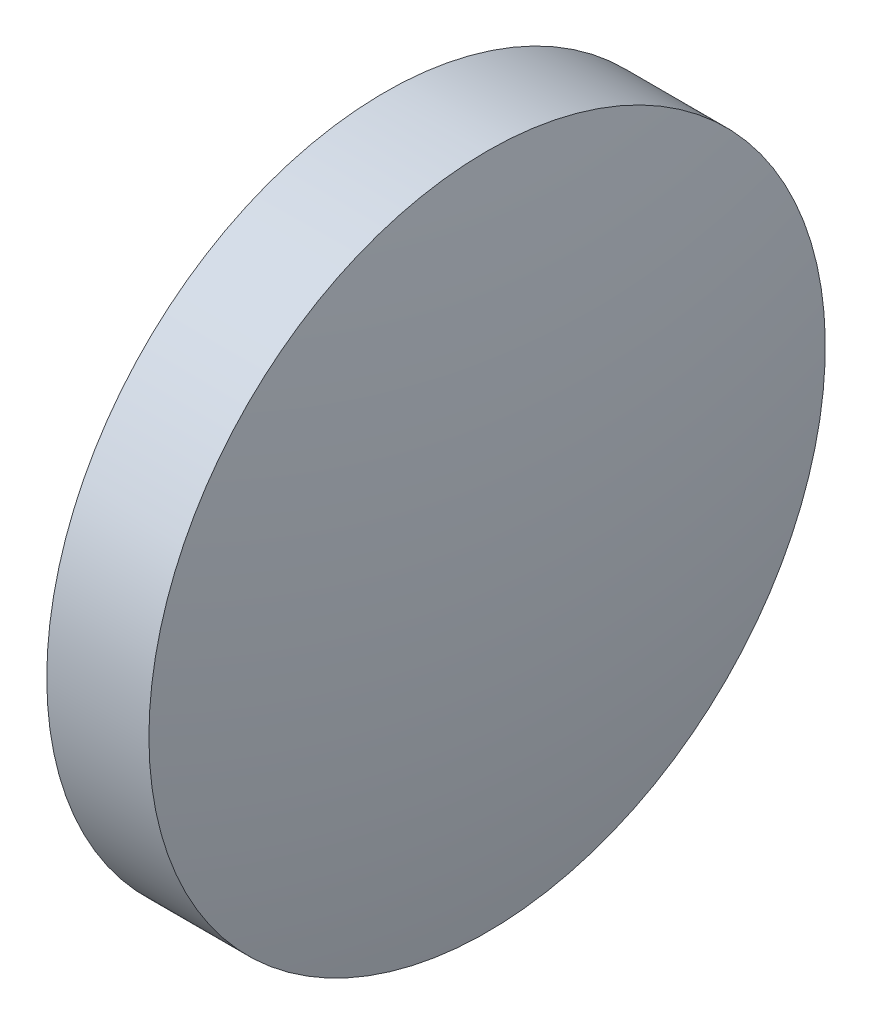
ISO-10303-21;
HEADER;
FILE_DESCRIPTION(('STEP AP214'),'2;1');
FILE_NAME('part.step','',(''),(''),'','','');
FILE_SCHEMA(('AUTOMOTIVE_DESIGN { 1 0 10303 214 1 1 1 1 }'));
ENDSEC;
DATA;
#1=APPLICATION_CONTEXT('core data for automotive mechanical design processes');
#2=APPLICATION_PROTOCOL_DEFINITION('international standard','automotive_design',2000,#1);
#3=PRODUCT_CONTEXT('',#1,'mechanical');
#4=PRODUCT('Part','Part','',(#3));
#5=PRODUCT_RELATED_PRODUCT_CATEGORY('part','',(#4));
#6=PRODUCT_DEFINITION_FORMATION('','',#4);
#7=PRODUCT_DEFINITION_CONTEXT('part definition',#1,'design');
#8=PRODUCT_DEFINITION('design','',#6,#7);
#9=PRODUCT_DEFINITION_SHAPE('','',#8);
#10=(LENGTH_UNIT() NAMED_UNIT(*) SI_UNIT(.MILLI.,.METRE.));
#11=(NAMED_UNIT(*) PLANE_ANGLE_UNIT() SI_UNIT($,.RADIAN.));
#12=(NAMED_UNIT(*) SI_UNIT($,.STERADIAN.) SOLID_ANGLE_UNIT());
#13=UNCERTAINTY_MEASURE_WITH_UNIT(LENGTH_MEASURE(1.E-05),#10,'distance_accuracy_value','');
#14=(GEOMETRIC_REPRESENTATION_CONTEXT(3) GLOBAL_UNCERTAINTY_ASSIGNED_CONTEXT((#13)) GLOBAL_UNIT_ASSIGNED_CONTEXT((#10,
#11,#12)) REPRESENTATION_CONTEXT('',''));
#15=CARTESIAN_POINT('',(0.,0.,0.));
#16=DIRECTION('',(0.,0.,1.));
#17=DIRECTION('',(1.,0.,0.));
#18=AXIS2_PLACEMENT_3D('',#15,#16,#17);
#19=CARTESIAN_POINT('',(439.610385490114,129.064025770373,0.));
#20=DIRECTION('',(-1.,0.,0.));
#21=DIRECTION('',(0.,1.,0.));
#22=AXIS2_PLACEMENT_3D('',#19,#20,#21);
#23=SPHERICAL_SURFACE('',#22,25.7552040816326);
#24=CARTESIAN_POINT('',(464.875589571747,129.064025770373,0.));
#25=DIRECTION('',(-1.,0.,0.));
#26=DIRECTION('',(0.,0.,1.));
#27=AXIS2_PLACEMENT_3D('',#24,#25,#26);
#28=CIRCLE('',#27,5.);
#29=CARTESIAN_POINT('',(464.875589571747,129.064025770373,5.));
#30=VERTEX_POINT('',#29);
#31=EDGE_CURVE('E10',#30,#30,#28,.T.);
#32=ORIENTED_EDGE('',*,*,#31,.F.);
#33=EDGE_LOOP('',(#32));
#34=FACE_BOUND('',#33,.T.);
#35=ADVANCED_FACE('F35',(#34),#23,.T.);
#36=CARTESIAN_POINT('',(462.567917317682,129.064025770373,0.));
#37=DIRECTION('',(-1.,0.,0.));
#38=DIRECTION('',(0.,0.,1.));
#39=AXIS2_PLACEMENT_3D('',#36,#37,#38);
#40=CYLINDRICAL_SURFACE('',#39,5.);
#41=CARTESIAN_POINT('',(463.365589571747,129.064025770373,0.));
#42=DIRECTION('',(-1.,0.,0.));
#43=DIRECTION('',(0.,0.,1.));
#44=AXIS2_PLACEMENT_3D('',#41,#42,#43);
#45=CIRCLE('',#44,5.);
#46=CARTESIAN_POINT('',(463.365589571747,129.064025770373,5.));
#47=VERTEX_POINT('',#46);
#48=EDGE_CURVE('E41',#47,#47,#45,.T.);
#49=ORIENTED_EDGE('',*,*,#48,.F.);
#50=EDGE_LOOP('',(#49));
#51=FACE_BOUND('',#50,.T.);
#52=ORIENTED_EDGE('',*,*,#31,.T.);
#53=EDGE_LOOP('',(#52));
#54=FACE_BOUND('',#53,.T.);
#55=ADVANCED_FACE('F49',(#51,#54),#40,.T.);
#56=CARTESIAN_POINT('',(463.365589571747,129.064025770373,0.));
#57=DIRECTION('',(1.,0.,0.));
#58=DIRECTION('',(0.,0.,-1.));
#59=AXIS2_PLACEMENT_3D('',#56,#57,#58);
#60=PLANE('',#59);
#61=ORIENTED_EDGE('',*,*,#48,.T.);
#62=EDGE_LOOP('',(#61));
#63=FACE_BOUND('',#62,.T.);
#64=ADVANCED_FACE('F47',(#63),#60,.F.);
#65=CLOSED_SHELL('',(#35,#55,#64));
#66=MANIFOLD_SOLID_BREP('B2',#65);
#67=ADVANCED_BREP_SHAPE_REPRESENTATION('',(#18,#66),#14);
#68=SHAPE_DEFINITION_REPRESENTATION(#9,#67);
ENDSEC;
END-ISO-10303-21;
